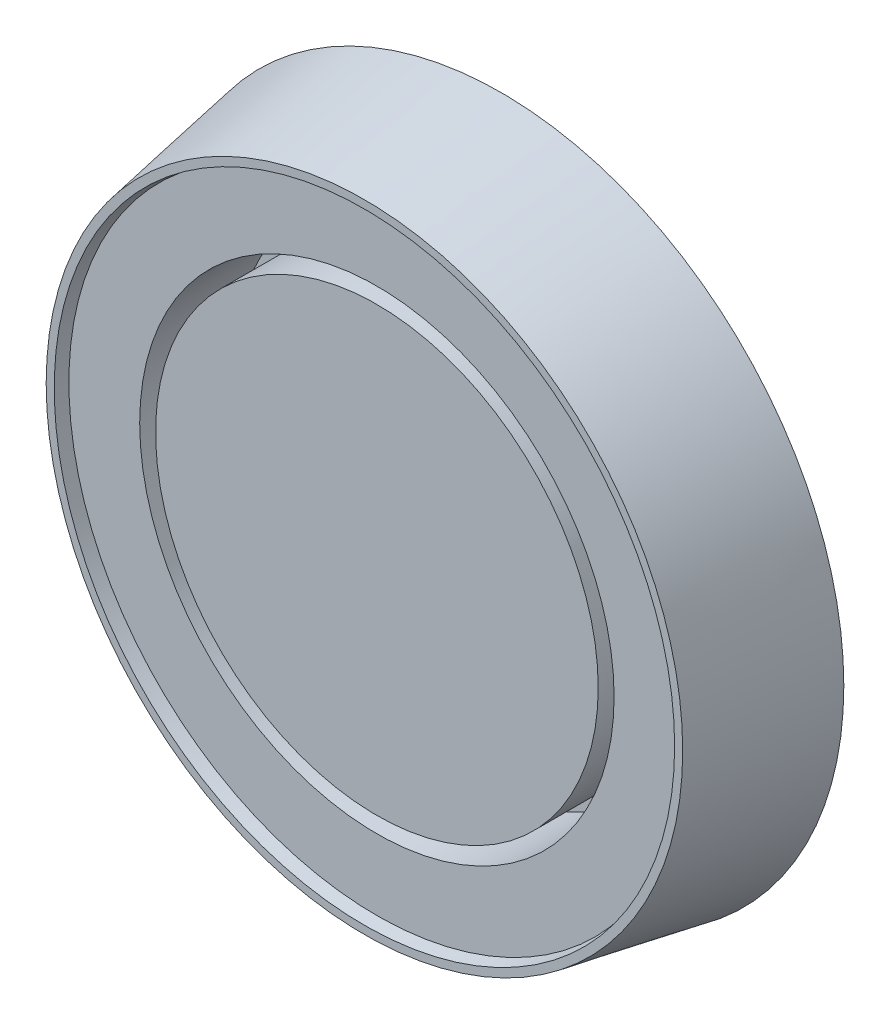
ISO-10303-21;
HEADER;
FILE_DESCRIPTION(('STEP AP214'),'2;1');
FILE_NAME('part.step','',(''),(''),'','','');
FILE_SCHEMA(('AUTOMOTIVE_DESIGN { 1 0 10303 214 1 1 1 1 }'));
ENDSEC;
DATA;
#1=APPLICATION_CONTEXT('core data for automotive mechanical design processes');
#2=APPLICATION_PROTOCOL_DEFINITION('international standard','automotive_design',2000,#1);
#3=PRODUCT_CONTEXT('',#1,'mechanical');
#4=PRODUCT('Part','Part','',(#3));
#5=PRODUCT_RELATED_PRODUCT_CATEGORY('part','',(#4));
#6=PRODUCT_DEFINITION_FORMATION('','',#4);
#7=PRODUCT_DEFINITION_CONTEXT('part definition',#1,'design');
#8=PRODUCT_DEFINITION('design','',#6,#7);
#9=PRODUCT_DEFINITION_SHAPE('','',#8);
#10=(LENGTH_UNIT() NAMED_UNIT(*) SI_UNIT(.MILLI.,.METRE.));
#11=(NAMED_UNIT(*) PLANE_ANGLE_UNIT() SI_UNIT($,.RADIAN.));
#12=(NAMED_UNIT(*) SI_UNIT($,.STERADIAN.) SOLID_ANGLE_UNIT());
#13=UNCERTAINTY_MEASURE_WITH_UNIT(LENGTH_MEASURE(1.E-05),#10,'distance_accuracy_value','');
#14=(GEOMETRIC_REPRESENTATION_CONTEXT(3) GLOBAL_UNCERTAINTY_ASSIGNED_CONTEXT((#13)) GLOBAL_UNIT_ASSIGNED_CONTEXT((#10,
#11,#12)) REPRESENTATION_CONTEXT('',''));
#15=CARTESIAN_POINT('',(0.,0.,0.));
#16=DIRECTION('',(0.,0.,1.));
#17=DIRECTION('',(1.,0.,0.));
#18=AXIS2_PLACEMENT_3D('',#15,#16,#17);
#19=CARTESIAN_POINT('',(0.,0.,20.));
#20=DIRECTION('',(0.,0.,1.));
#21=DIRECTION('',(1.,0.,0.));
#22=AXIS2_PLACEMENT_3D('',#19,#20,#21);
#23=PLANE('',#22);
#24=CARTESIAN_POINT('',(0.,0.,20.));
#25=DIRECTION('',(0.,0.,1.));
#26=DIRECTION('',(1.,0.,0.));
#27=AXIS2_PLACEMENT_3D('',#24,#25,#26);
#28=CIRCLE('',#27,38.1);
#29=CARTESIAN_POINT('',(38.1,0.,20.));
#30=VERTEX_POINT('',#29);
#31=EDGE_CURVE('E60',#30,#30,#28,.T.);
#32=ORIENTED_EDGE('',*,*,#31,.F.);
#33=EDGE_LOOP('',(#32));
#34=FACE_BOUND('',#33,.T.);
#35=CARTESIAN_POINT('',(0.,0.,20.));
#36=DIRECTION('',(0.,0.,1.));
#37=DIRECTION('',(1.,0.,0.));
#38=AXIS2_PLACEMENT_3D('',#35,#36,#37);
#39=CIRCLE('',#38,49.4734603858307);
#40=CARTESIAN_POINT('',(49.4734603858307,0.,20.));
#41=VERTEX_POINT('',#40);
#42=EDGE_CURVE('E11',#41,#41,#39,.F.);
#43=ORIENTED_EDGE('',*,*,#42,.F.);
#44=EDGE_LOOP('',(#43));
#45=FACE_BOUND('',#44,.T.);
#46=ADVANCED_FACE('F39',(#34,#45),#23,.T.);
#47=CARTESIAN_POINT('',(0.,0.,-107.76307345283));
#48=DIRECTION('',(0.,0.,1.));
#49=DIRECTION('',(1.,0.,0.));
#50=AXIS2_PLACEMENT_3D('',#47,#48,#49);
#51=CYLINDRICAL_SURFACE('',#50,38.1);
#52=CARTESIAN_POINT('',(0.,0.,5.));
#53=DIRECTION('',(0.,0.,1.));
#54=DIRECTION('',(1.,0.,0.));
#55=AXIS2_PLACEMENT_3D('',#52,#53,#54);
#56=CIRCLE('',#55,38.1);
#57=CARTESIAN_POINT('',(38.1,0.,5.));
#58=VERTEX_POINT('',#57);
#59=EDGE_CURVE('E57',#58,#58,#56,.F.);
#60=ORIENTED_EDGE('',*,*,#59,.T.);
#61=EDGE_LOOP('',(#60));
#62=FACE_BOUND('',#61,.T.);
#63=ORIENTED_EDGE('',*,*,#31,.T.);
#64=EDGE_LOOP('',(#63));
#65=FACE_BOUND('',#64,.T.);
#66=ADVANCED_FACE('F91',(#62,#65),#51,.F.);
#67=CARTESIAN_POINT('',(0.,0.,-107.76307345283));
#68=DIRECTION('',(0.,0.,1.));
#69=DIRECTION('',(1.,0.,0.));
#70=AXIS2_PLACEMENT_3D('',#67,#68,#69);
#71=CYLINDRICAL_SURFACE('',#70,35.55);
#72=CARTESIAN_POINT('',(0.,0.,5.));
#73=DIRECTION('',(0.,0.,1.));
#74=DIRECTION('',(1.,0.,0.));
#75=AXIS2_PLACEMENT_3D('',#72,#73,#74);
#76=CIRCLE('',#75,35.55);
#77=CARTESIAN_POINT('',(35.55,0.,5.));
#78=VERTEX_POINT('',#77);
#79=EDGE_CURVE('E52',#78,#78,#76,.F.);
#80=ORIENTED_EDGE('',*,*,#79,.F.);
#81=EDGE_LOOP('',(#80));
#82=FACE_BOUND('',#81,.T.);
#83=CARTESIAN_POINT('',(0.,0.,20.));
#84=DIRECTION('',(0.,0.,1.));
#85=DIRECTION('',(1.,0.,0.));
#86=AXIS2_PLACEMENT_3D('',#83,#84,#85);
#87=CIRCLE('',#86,35.55);
#88=CARTESIAN_POINT('',(35.55,0.,20.));
#89=VERTEX_POINT('',#88);
#90=EDGE_CURVE('E64',#89,#89,#87,.T.);
#91=ORIENTED_EDGE('',*,*,#90,.F.);
#92=EDGE_LOOP('',(#91));
#93=FACE_BOUND('',#92,.T.);
#94=ADVANCED_FACE('F98',(#82,#93),#71,.T.);
#95=CARTESIAN_POINT('',(0.,0.,5.));
#96=DIRECTION('',(0.,0.,1.));
#97=DIRECTION('',(1.,0.,0.));
#98=AXIS2_PLACEMENT_3D('',#95,#96,#97);
#99=PLANE('',#98);
#100=ORIENTED_EDGE('',*,*,#59,.F.);
#101=EDGE_LOOP('',(#100));
#102=FACE_BOUND('',#101,.T.);
#103=ORIENTED_EDGE('',*,*,#79,.T.);
#104=EDGE_LOOP('',(#103));
#105=FACE_BOUND('',#104,.T.);
#106=ADVANCED_FACE('F104',(#102,#105),#99,.T.);
#107=ORIENTED_EDGE('',*,*,#90,.T.);
#108=EDGE_LOOP('',(#107));
#109=FACE_BOUND('',#108,.T.);
#110=ADVANCED_FACE('F94',(#109),#23,.T.);
#111=CARTESIAN_POINT('',(0.,0.,22.));
#112=DIRECTION('',(0.,0.,1.));
#113=DIRECTION('',(1.,0.,0.));
#114=AXIS2_PLACEMENT_3D('',#111,#112,#113);
#115=PLANE('',#114);
#116=CARTESIAN_POINT('',(0.,0.,22.));
#117=DIRECTION('',(0.,0.,1.));
#118=DIRECTION('',(1.,0.,0.));
#119=AXIS2_PLACEMENT_3D('',#116,#117,#118);
#120=CIRCLE('',#119,51.1208064244138);
#121=CARTESIAN_POINT('',(51.1208064244138,0.,22.));
#122=VERTEX_POINT('',#121);
#123=EDGE_CURVE('E68',#122,#122,#120,.T.);
#124=ORIENTED_EDGE('',*,*,#123,.T.);
#125=EDGE_LOOP('',(#124));
#126=FACE_BOUND('',#125,.T.);
#127=CARTESIAN_POINT('',(0.,0.,22.));
#128=DIRECTION('',(0.,0.,1.));
#129=DIRECTION('',(1.,0.,0.));
#130=AXIS2_PLACEMENT_3D('',#127,#128,#129);
#131=CIRCLE('',#130,49.8261143472476);
#132=CARTESIAN_POINT('',(49.8261143472476,0.,22.));
#133=VERTEX_POINT('',#132);
#134=EDGE_CURVE('E72',#133,#133,#131,.T.);
#135=ORIENTED_EDGE('',*,*,#134,.F.);
#136=EDGE_LOOP('',(#135));
#137=FACE_BOUND('',#136,.T.);
#138=ADVANCED_FACE('F80',(#126,#137),#115,.T.);
#139=CARTESIAN_POINT('',(0.,0.,20.));
#140=DIRECTION('',(0.,0.,1.));
#141=DIRECTION('',(1.,0.,0.));
#142=AXIS2_PLACEMENT_3D('',#139,#140,#141);
#143=CONICAL_SURFACE('',#142,49.4734603858307,0.174532925199433);
#144=ORIENTED_EDGE('',*,*,#134,.T.);
#145=EDGE_LOOP('',(#144));
#146=FACE_BOUND('',#145,.T.);
#147=ORIENTED_EDGE('',*,*,#42,.T.);
#148=EDGE_LOOP('',(#147));
#149=FACE_BOUND('',#148,.T.);
#150=ADVANCED_FACE('F88',(#146,#149),#143,.F.);
#151=CARTESIAN_POINT('',(0.,0.,0.));
#152=DIRECTION('',(0.,0.,1.));
#153=DIRECTION('',(1.,0.,0.));
#154=AXIS2_PLACEMENT_3D('',#151,#152,#153);
#155=PLANE('',#154);
#156=CARTESIAN_POINT('',(0.,0.,0.));
#157=DIRECTION('',(0.,0.,1.));
#158=DIRECTION('',(1.,0.,0.));
#159=AXIS2_PLACEMENT_3D('',#156,#157,#158);
#160=CIRCLE('',#159,55.);
#161=CARTESIAN_POINT('',(55.,0.,0.));
#162=VERTEX_POINT('',#161);
#163=EDGE_CURVE('E47',#162,#162,#160,.T.);
#164=ORIENTED_EDGE('',*,*,#163,.F.);
#165=EDGE_LOOP('',(#164));
#166=FACE_BOUND('',#165,.T.);
#167=ADVANCED_FACE('F84',(#166),#155,.F.);
#168=CARTESIAN_POINT('',(0.,0.,0.));
#169=DIRECTION('',(0.,0.,-1.));
#170=DIRECTION('',(1.,0.,0.));
#171=AXIS2_PLACEMENT_3D('',#168,#169,#170);
#172=CONICAL_SURFACE('',#171,55.,0.174532925199433);
#173=ORIENTED_EDGE('',*,*,#163,.T.);
#174=EDGE_LOOP('',(#173));
#175=FACE_BOUND('',#174,.T.);
#176=ORIENTED_EDGE('',*,*,#123,.F.);
#177=EDGE_LOOP('',(#176));
#178=FACE_BOUND('',#177,.T.);
#179=ADVANCED_FACE('F41',(#175,#178),#172,.T.);
#180=CLOSED_SHELL('',(#46,#66,#94,#106,#110,#138,#150,#167,#179));
#181=MANIFOLD_SOLID_BREP('B2',#180);
#182=ADVANCED_BREP_SHAPE_REPRESENTATION('',(#18,#181),#14);
#183=SHAPE_DEFINITION_REPRESENTATION(#9,#182);
ENDSEC;
END-ISO-10303-21;
